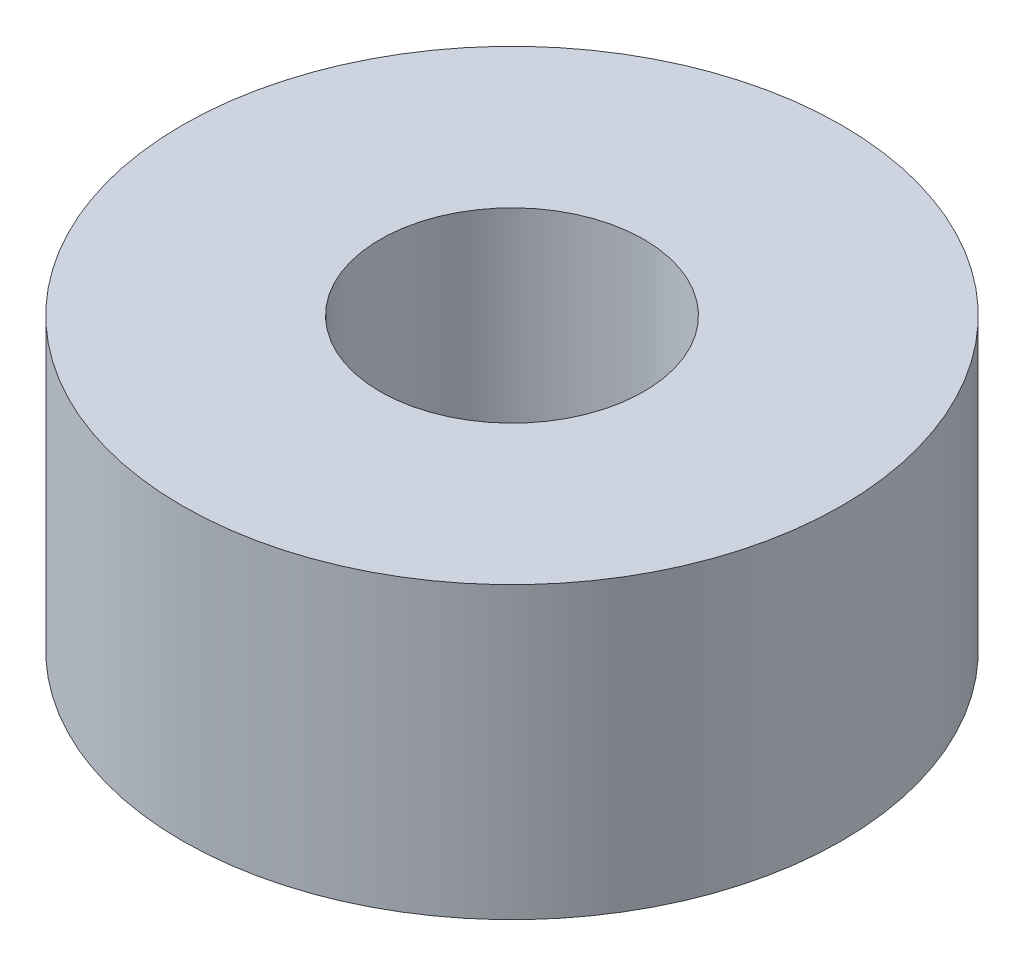
ISO-10303-21;
HEADER;
FILE_DESCRIPTION(('STEP AP214'),'2;1');
FILE_NAME('part.step','',(''),(''),'','','');
FILE_SCHEMA(('AUTOMOTIVE_DESIGN { 1 0 10303 214 1 1 1 1 }'));
ENDSEC;
DATA;
#1=APPLICATION_CONTEXT('core data for automotive mechanical design processes');
#2=APPLICATION_PROTOCOL_DEFINITION('international standard','automotive_design',2000,#1);
#3=PRODUCT_CONTEXT('',#1,'mechanical');
#4=PRODUCT('Part','Part','',(#3));
#5=PRODUCT_RELATED_PRODUCT_CATEGORY('part','',(#4));
#6=PRODUCT_DEFINITION_FORMATION('','',#4);
#7=PRODUCT_DEFINITION_CONTEXT('part definition',#1,'design');
#8=PRODUCT_DEFINITION('design','',#6,#7);
#9=PRODUCT_DEFINITION_SHAPE('','',#8);
#10=(LENGTH_UNIT() NAMED_UNIT(*) SI_UNIT(.MILLI.,.METRE.));
#11=(NAMED_UNIT(*) PLANE_ANGLE_UNIT() SI_UNIT($,.RADIAN.));
#12=(NAMED_UNIT(*) SI_UNIT($,.STERADIAN.) SOLID_ANGLE_UNIT());
#13=UNCERTAINTY_MEASURE_WITH_UNIT(LENGTH_MEASURE(1.E-05),#10,'distance_accuracy_value','');
#14=(GEOMETRIC_REPRESENTATION_CONTEXT(3) GLOBAL_UNCERTAINTY_ASSIGNED_CONTEXT((#13)) GLOBAL_UNIT_ASSIGNED_CONTEXT((#10,
#11,#12)) REPRESENTATION_CONTEXT('',''));
#15=CARTESIAN_POINT('',(0.,0.,0.));
#16=DIRECTION('',(0.,0.,1.));
#17=DIRECTION('',(1.,0.,0.));
#18=AXIS2_PLACEMENT_3D('',#15,#16,#17);
#19=CARTESIAN_POINT('',(0.,2.2,0.));
#20=DIRECTION('',(0.,1.,0.));
#21=DIRECTION('',(0.,0.,1.));
#22=AXIS2_PLACEMENT_3D('',#19,#20,#21);
#23=PLANE('',#22);
#24=CARTESIAN_POINT('',(0.,2.2,0.));
#25=DIRECTION('',(0.,1.,0.));
#26=DIRECTION('',(0.,0.,1.));
#27=AXIS2_PLACEMENT_3D('',#24,#25,#26);
#28=CIRCLE('',#27,2.5);
#29=CARTESIAN_POINT('',(0.,2.2,2.5));
#30=VERTEX_POINT('',#29);
#31=EDGE_CURVE('E10',#30,#30,#28,.T.);
#32=ORIENTED_EDGE('',*,*,#31,.T.);
#33=EDGE_LOOP('',(#32));
#34=FACE_BOUND('',#33,.T.);
#35=CARTESIAN_POINT('',(0.,2.2,0.));
#36=DIRECTION('',(0.,1.,0.));
#37=DIRECTION('',(0.,0.,1.));
#38=AXIS2_PLACEMENT_3D('',#35,#36,#37);
#39=CIRCLE('',#38,1.);
#40=CARTESIAN_POINT('',(0.,2.2,1.));
#41=VERTEX_POINT('',#40);
#42=EDGE_CURVE('E46',#41,#41,#39,.T.);
#43=ORIENTED_EDGE('',*,*,#42,.F.);
#44=EDGE_LOOP('',(#43));
#45=FACE_BOUND('',#44,.T.);
#46=ADVANCED_FACE('F35',(#34,#45),#23,.T.);
#47=CARTESIAN_POINT('',(0.,0.,0.));
#48=DIRECTION('',(0.,1.,0.));
#49=DIRECTION('',(0.,0.,1.));
#50=AXIS2_PLACEMENT_3D('',#47,#48,#49);
#51=PLANE('',#50);
#52=CARTESIAN_POINT('',(0.,0.,0.));
#53=DIRECTION('',(0.,1.,0.));
#54=DIRECTION('',(0.,0.,1.));
#55=AXIS2_PLACEMENT_3D('',#52,#53,#54);
#56=CIRCLE('',#55,2.5);
#57=CARTESIAN_POINT('',(0.,0.,2.5));
#58=VERTEX_POINT('',#57);
#59=EDGE_CURVE('E39',#58,#58,#56,.T.);
#60=ORIENTED_EDGE('',*,*,#59,.F.);
#61=EDGE_LOOP('',(#60));
#62=FACE_BOUND('',#61,.T.);
#63=CARTESIAN_POINT('',(0.,0.,0.));
#64=DIRECTION('',(0.,1.,0.));
#65=DIRECTION('',(0.,0.,1.));
#66=AXIS2_PLACEMENT_3D('',#63,#64,#65);
#67=CIRCLE('',#66,1.);
#68=CARTESIAN_POINT('',(0.,0.,1.));
#69=VERTEX_POINT('',#68);
#70=EDGE_CURVE('E48',#69,#69,#67,.T.);
#71=ORIENTED_EDGE('',*,*,#70,.T.);
#72=EDGE_LOOP('',(#71));
#73=FACE_BOUND('',#72,.T.);
#74=ADVANCED_FACE('F58',(#62,#73),#51,.F.);
#75=CARTESIAN_POINT('',(0.,2.2,0.));
#76=DIRECTION('',(0.,-1.,0.));
#77=DIRECTION('',(0.,0.,-1.));
#78=AXIS2_PLACEMENT_3D('',#75,#76,#77);
#79=CYLINDRICAL_SURFACE('',#78,2.5);
#80=ORIENTED_EDGE('',*,*,#31,.F.);
#81=EDGE_LOOP('',(#80));
#82=FACE_BOUND('',#81,.T.);
#83=ORIENTED_EDGE('',*,*,#59,.T.);
#84=EDGE_LOOP('',(#83));
#85=FACE_BOUND('',#84,.T.);
#86=ADVANCED_FACE('F37',(#82,#85),#79,.T.);
#87=CARTESIAN_POINT('',(0.,2.2,0.));
#88=DIRECTION('',(0.,-1.,0.));
#89=DIRECTION('',(0.,0.,-1.));
#90=AXIS2_PLACEMENT_3D('',#87,#88,#89);
#91=CYLINDRICAL_SURFACE('',#90,1.);
#92=ORIENTED_EDGE('',*,*,#42,.T.);
#93=EDGE_LOOP('',(#92));
#94=FACE_BOUND('',#93,.T.);
#95=ORIENTED_EDGE('',*,*,#70,.F.);
#96=EDGE_LOOP('',(#95));
#97=FACE_BOUND('',#96,.T.);
#98=ADVANCED_FACE('F54',(#94,#97),#91,.F.);
#99=CLOSED_SHELL('',(#46,#74,#86,#98));
#100=MANIFOLD_SOLID_BREP('B2',#99);
#101=ADVANCED_BREP_SHAPE_REPRESENTATION('',(#18,#100),#14);
#102=SHAPE_DEFINITION_REPRESENTATION(#9,#101);
ENDSEC;
END-ISO-10303-21;
